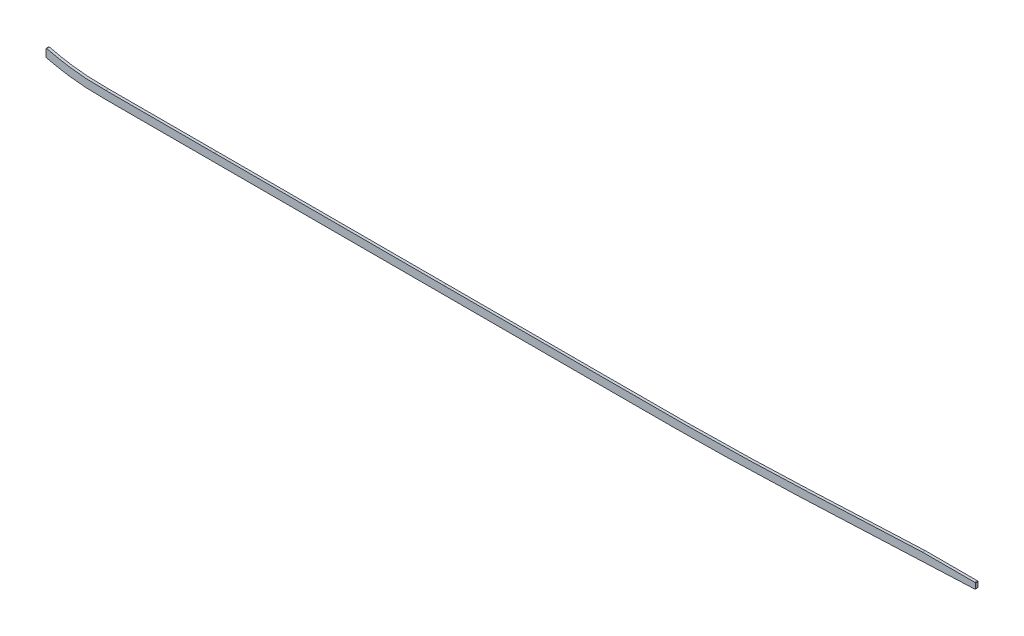
ISO-10303-21;
HEADER;
FILE_DESCRIPTION(('STEP AP214'),'2;1');
FILE_NAME('part.step','',(''),(''),'','','');
FILE_SCHEMA(('AUTOMOTIVE_DESIGN { 1 0 10303 214 1 1 1 1 }'));
ENDSEC;
DATA;
#1=APPLICATION_CONTEXT('core data for automotive mechanical design processes');
#2=APPLICATION_PROTOCOL_DEFINITION('international standard','automotive_design',2000,#1);
#3=PRODUCT_CONTEXT('',#1,'mechanical');
#4=PRODUCT('Part','Part','',(#3));
#5=PRODUCT_RELATED_PRODUCT_CATEGORY('part','',(#4));
#6=PRODUCT_DEFINITION_FORMATION('','',#4);
#7=PRODUCT_DEFINITION_CONTEXT('part definition',#1,'design');
#8=PRODUCT_DEFINITION('design','',#6,#7);
#9=PRODUCT_DEFINITION_SHAPE('','',#8);
#10=(LENGTH_UNIT() NAMED_UNIT(*) SI_UNIT(.MILLI.,.METRE.));
#11=(NAMED_UNIT(*) PLANE_ANGLE_UNIT() SI_UNIT($,.RADIAN.));
#12=(NAMED_UNIT(*) SI_UNIT($,.STERADIAN.) SOLID_ANGLE_UNIT());
#13=UNCERTAINTY_MEASURE_WITH_UNIT(LENGTH_MEASURE(1.E-05),#10,'distance_accuracy_value','');
#14=(GEOMETRIC_REPRESENTATION_CONTEXT(3) GLOBAL_UNCERTAINTY_ASSIGNED_CONTEXT((#13)) GLOBAL_UNIT_ASSIGNED_CONTEXT((#10,
#11,#12)) REPRESENTATION_CONTEXT('',''));
#15=CARTESIAN_POINT('',(0.,0.,0.));
#16=DIRECTION('',(0.,0.,1.));
#17=DIRECTION('',(1.,0.,0.));
#18=AXIS2_PLACEMENT_3D('',#15,#16,#17);
#19=CARTESIAN_POINT('',(2699.79233294449,-7.52454325644929,3.175));
#20=CARTESIAN_POINT('',(2639.63682069028,-11.6572294058032,3.175));
#21=CARTESIAN_POINT('',(2579.48130742255,-15.435846921513,3.175));
#22=CARTESIAN_POINT('',(2518.49810546626,-19.1485286488731,3.175));
#23=CARTESIAN_POINT('',(2436.3555443117,-23.2523639114786,3.175));
#24=CARTESIAN_POINT('',(2354.21298315715,-26.6314864233564,3.175));
#25=CARTESIAN_POINT('',(2332.5703304682,-27.4809881692809,3.175));
#26=CARTESIAN_POINT('',(2156.26863942885,-34.3777685431634,3.175));
#27=CARTESIAN_POINT('',(1979.96694737597,-41.6286312484567,3.175));
#28=CARTESIAN_POINT('',(1824.11427763497,-52.7712658766203,3.175));
#29=CARTESIAN_POINT('',(1636.92860677809,-53.5795698486924,3.175));
#30=CARTESIAN_POINT('',(1449.7429359212,-53.4540246131279,3.175));
#31=CARTESIAN_POINT('',(1418.00673093479,-53.4707027968771,3.175));
#32=CARTESIAN_POINT('',(1324.89933614602,-53.4707027968771,3.175));
#33=CARTESIAN_POINT('',(1231.79194034372,-53.4707027968771,3.175));
#34=CARTESIAN_POINT('',(1170.4412693194,-53.4707027968771,3.175));
#35=CARTESIAN_POINT('',(1108.78407581299,-53.4707027968771,3.175));
#36=CARTESIAN_POINT('',(1047.12688234629,-53.4707027968771,3.175));
#37=CARTESIAN_POINT('',(1046.84641418849,-53.4707027968771,3.175));
#38=CARTESIAN_POINT('',(1046.56594718406,-53.4707027968771,3.175));
#39=CARTESIAN_POINT('',(1046.28548189005,-53.4707027968771,3.175));
#40=(BOUNDED_CURVE() B_SPLINE_CURVE(5,(#19,#20,#21,#22,#23,#24,#25,#26,#27,#28,#29,#30,#31,#32,
#33,#34,#35,#36,#37,#38,#39),.UNSPECIFIED.,.F.,.F.) B_SPLINE_CURVE_WITH_KNOTS((6,3,3,3,3,3,6),
(100.654804519159,130.927896619159,141.337054719159,218.101815019159,233.772059419159,
264.077723219159,264.2162088),
.UNSPECIFIED.) CURVE() GEOMETRIC_REPRESENTATION_ITEM() RATIONAL_B_SPLINE_CURVE((1.,1.,1.,1.,1.,
1.,1.,1.,1.,1.,1.,1.,1.,1.,1.,1.,1.,1.,1.,1.,1.)) REPRESENTATION_ITEM(''));
#41=DIRECTION('',(0.,0.,-1.));
#42=VECTOR('',#41,1.);
#43=SURFACE_OF_LINEAR_EXTRUSION('',#40,#42);
#44=CARTESIAN_POINT('',(2699.79233294449,-7.52454325644929,-3.175));
#45=CARTESIAN_POINT('',(2639.63682069028,-11.6572294058032,-3.175));
#46=CARTESIAN_POINT('',(2579.48130742255,-15.435846921513,-3.175));
#47=CARTESIAN_POINT('',(2518.49810546626,-19.1485286488731,-3.175));
#48=CARTESIAN_POINT('',(2436.3555443117,-23.2523639114786,-3.175));
#49=CARTESIAN_POINT('',(2354.21298315715,-26.6314864233564,-3.175));
#50=CARTESIAN_POINT('',(2332.5703304682,-27.4809881692809,-3.175));
#51=CARTESIAN_POINT('',(2156.26863942885,-34.3777685431634,-3.175));
#52=CARTESIAN_POINT('',(1979.96694737597,-41.6286312484567,-3.175));
#53=CARTESIAN_POINT('',(1824.11427763497,-52.7712658766203,-3.175));
#54=CARTESIAN_POINT('',(1636.92860677809,-53.5795698486924,-3.175));
#55=CARTESIAN_POINT('',(1449.7429359212,-53.4540246131279,-3.175));
#56=CARTESIAN_POINT('',(1418.00673093479,-53.4707027968771,-3.175));
#57=CARTESIAN_POINT('',(1324.89933614602,-53.4707027968771,-3.175));
#58=CARTESIAN_POINT('',(1231.79194034372,-53.4707027968771,-3.175));
#59=CARTESIAN_POINT('',(1170.4412693194,-53.4707027968771,-3.175));
#60=CARTESIAN_POINT('',(1108.78407581299,-53.4707027968771,-3.175));
#61=CARTESIAN_POINT('',(1047.12688234629,-53.4707027968771,-3.175));
#62=CARTESIAN_POINT('',(1046.84641418849,-53.4707027968771,-3.175));
#63=CARTESIAN_POINT('',(1046.56594718406,-53.4707027968771,-3.175));
#64=CARTESIAN_POINT('',(1046.28548189005,-53.4707027968771,-3.175));
#65=(BOUNDED_CURVE() B_SPLINE_CURVE(5,(#44,#45,#46,#47,#48,#49,#50,#51,#52,#53,#54,#55,#56,#57,
#58,#59,#60,#61,#62,#63,#64),.UNSPECIFIED.,.F.,.F.) B_SPLINE_CURVE_WITH_KNOTS((6,3,3,3,3,3,6),
(100.654804519159,130.927896619159,141.337054719159,218.101815019159,233.772059419159,
264.077723219159,264.2162088),
.UNSPECIFIED.) CURVE() GEOMETRIC_REPRESENTATION_ITEM() RATIONAL_B_SPLINE_CURVE((1.,1.,1.,1.,1.,
1.,1.,1.,1.,1.,1.,1.,1.,1.,1.,1.,1.,1.,1.,1.,1.)) REPRESENTATION_ITEM(''));
#66=CARTESIAN_POINT('',(2310.1798600934,-28.3582988228307,-3.175));
#67=VERTEX_POINT('',#66);
#68=CARTESIAN_POINT('',(1046.28548189005,-53.4707027968771,-3.175));
#69=VERTEX_POINT('',#68);
#70=EDGE_CURVE('E200',#67,#69,#65,.T.);
#71=ORIENTED_EDGE('',*,*,#70,.F.);
#72=DIRECTION('',(0.,0.,-1.));
#73=VECTOR('',#72,1.);
#74=CARTESIAN_POINT('',(2310.1798600934,-28.3582988228307,-3.175));
#75=LINE('',#74,#73);
#76=CARTESIAN_POINT('',(2310.1798600934,-28.3582988228307,3.175));
#77=VERTEX_POINT('',#76);
#78=EDGE_CURVE('E203',#67,#77,#75,.F.);
#79=ORIENTED_EDGE('',*,*,#78,.T.);
#80=CARTESIAN_POINT('',(1046.28548189005,-53.4707027968771,3.175));
#81=VERTEX_POINT('',#80);
#82=EDGE_CURVE('E197',#77,#81,#40,.T.);
#83=ORIENTED_EDGE('',*,*,#82,.T.);
#84=DIRECTION('',(0.,0.,-1.));
#85=VECTOR('',#84,1.);
#86=CARTESIAN_POINT('',(1046.28548189005,-53.4707027968771,3.175));
#87=LINE('',#86,#85);
#88=EDGE_CURVE('E168',#81,#69,#87,.T.);
#89=ORIENTED_EDGE('',*,*,#88,.T.);
#90=EDGE_LOOP('',(#71,#79,#83,#89));
#91=FACE_BOUND('',#90,.T.);
#92=ADVANCED_FACE('F36',(#91),#43,.T.);
#93=CARTESIAN_POINT('',(2698.48667469404,11.4806601503293,3.175));
#94=CARTESIAN_POINT('',(2691.24737670604,10.9833200828121,3.175));
#95=CARTESIAN_POINT('',(2679.19516047804,10.1655376868452,3.175));
#96=CARTESIAN_POINT('',(2662.27652557768,9.03876140898899,3.175));
#97=CARTESIAN_POINT('',(2635.66628230206,7.2924691456857,3.175));
#98=CARTESIAN_POINT('',(2596.85766552893,4.8260568530791,3.175));
#99=CARTESIAN_POINT('',(2545.72974303923,1.75834409257586,3.175));
#100=CARTESIAN_POINT('',(2494.40530570724,-1.09855523520035,3.175));
#101=CARTESIAN_POINT('',(2451.53302226734,-3.26657329681936,3.175));
#102=CARTESIAN_POINT('',(2417.1983167563,-4.86708361008882,3.175));
#103=CARTESIAN_POINT('',(2391.45707691927,-6.00358923536048,3.175));
#104=CARTESIAN_POINT('',(2365.63473630713,-7.08685458139135,3.175));
#105=CARTESIAN_POINT('',(2339.54628467245,-8.13772994402807,3.175));
#106=CARTESIAN_POINT('',(2313.46613297408,-9.16513837136649,3.175));
#107=CARTESIAN_POINT('',(2287.61237548634,-10.1794782148021,3.175));
#108=CARTESIAN_POINT('',(2261.7633474368,-11.2010322967668,3.175));
#109=CARTESIAN_POINT('',(2227.28532971514,-12.5838425566113,3.175));
#110=CARTESIAN_POINT('',(2184.17556939327,-14.3660723604172,3.175));
#111=CARTESIAN_POINT('',(2132.42906611447,-16.6074278682384,3.175));
#112=CARTESIAN_POINT('',(2063.42552339989,-19.708920484548,3.175));
#113=CARTESIAN_POINT('',(1977.17490763451,-23.7005433130483,3.175));
#114=CARTESIAN_POINT('',(1873.73245143151,-28.149389220677,3.175));
#115=CARTESIAN_POINT('',(1770.37461881016,-31.6574686487852,3.175));
#116=CARTESIAN_POINT('',(1667.08568781321,-33.7931175563218,3.175));
#117=CARTESIAN_POINT('',(1581.01109449057,-34.3831888311612,3.175));
#118=CARTESIAN_POINT('',(1512.07397125959,-34.4278026003723,3.175));
#119=CARTESIAN_POINT('',(1443.06151347714,-34.4095104024296,3.175));
#120=CARTESIAN_POINT('',(1356.80092787913,-34.4244328117572,3.175));
#121=CARTESIAN_POINT('',(1218.79462695393,-34.4184647879491,3.175));
#122=CARTESIAN_POINT('',(1115.28902278569,-34.4207027968771,3.175));
#123=CARTESIAN_POINT('',(1046.28548189005,-34.4207027968771,3.175));
#124=B_SPLINE_CURVE_WITH_KNOTS('',3,(#93,#94,#95,#96,#97,#98,#99,#100,#101,#102,#103,#104,#105,
#106,#107,#108,#109,#110,#111,#112,#113,#114,#115,#116,#117,#118,#119,#120,#121,#122,#123),
.UNSPECIFIED.,.F.,.F.,(4,1,1,1,1,1,1,1,1,1,1,1,1,1,1,1,1,1,1,1,1,1,1,1,1,1,1,1,4),
(100.654804519159,102.842388131745,104.300777206802,105.766098402935,110.877392286712,
115.988686170488,121.099980054264,126.21127393804,128.766920879929,131.322567821817,
133.878214763705,136.433861705593,138.989508647481,141.545155589369,144.100802531257,
146.656449473146,151.767743356922,156.879037240698,161.990331124474,172.212918892027,
182.43550665958,192.658094427132,202.880682194685,213.103269962237,218.214563846014,
223.32585772979,233.548445497342,243.771033264895,264.2162088),.UNSPECIFIED.);
#125=DIRECTION('',(0.,0.,-1.));
#126=VECTOR('',#125,1.);
#127=SURFACE_OF_LINEAR_EXTRUSION('',#124,#126);
#128=CARTESIAN_POINT('',(2185.53298554095,-14.3256597243202,3.175));
#129=VERTEX_POINT('',#128);
#130=CARTESIAN_POINT('',(1046.28548189005,-34.4207027968771,3.175));
#131=VERTEX_POINT('',#130);
#132=EDGE_CURVE('E182',#129,#131,#124,.T.);
#133=ORIENTED_EDGE('',*,*,#132,.F.);
#134=CARTESIAN_POINT('',(2185.5329855252,-14.3256597249861,3.175));
#135=DIRECTION('',(0.,0.,-1.));
#136=VECTOR('',#135,1.);
#137=LINE('',#134,#136);
#138=CARTESIAN_POINT('',(2185.53298554095,-14.3256597243202,-3.175));
#139=VERTEX_POINT('',#138);
#140=EDGE_CURVE('E207',#139,#129,#137,.F.);
#141=ORIENTED_EDGE('',*,*,#140,.F.);
#142=CARTESIAN_POINT('',(2698.48667469404,11.4806601503293,-3.175));
#143=CARTESIAN_POINT('',(2691.24737670604,10.9833200828121,-3.175));
#144=CARTESIAN_POINT('',(2679.19516047804,10.1655376868452,-3.175));
#145=CARTESIAN_POINT('',(2662.27652557768,9.03876140898899,-3.175));
#146=CARTESIAN_POINT('',(2635.66628230206,7.2924691456857,-3.175));
#147=CARTESIAN_POINT('',(2596.85766552893,4.8260568530791,-3.175));
#148=CARTESIAN_POINT('',(2545.72974303923,1.75834409257586,-3.175));
#149=CARTESIAN_POINT('',(2494.40530570724,-1.09855523520035,-3.175));
#150=CARTESIAN_POINT('',(2451.53302226734,-3.26657329681936,-3.175));
#151=CARTESIAN_POINT('',(2417.1983167563,-4.86708361008882,-3.175));
#152=CARTESIAN_POINT('',(2391.45707691927,-6.00358923536048,-3.175));
#153=CARTESIAN_POINT('',(2365.63473630713,-7.08685458139135,-3.175));
#154=CARTESIAN_POINT('',(2339.54628467245,-8.13772994402807,-3.175));
#155=CARTESIAN_POINT('',(2313.46613297408,-9.16513837136649,-3.175));
#156=CARTESIAN_POINT('',(2287.61237548634,-10.1794782148021,-3.175));
#157=CARTESIAN_POINT('',(2261.7633474368,-11.2010322967668,-3.175));
#158=CARTESIAN_POINT('',(2227.28532971514,-12.5838425566113,-3.175));
#159=CARTESIAN_POINT('',(2184.17556939327,-14.3660723604172,-3.175));
#160=CARTESIAN_POINT('',(2132.42906611447,-16.6074278682384,-3.175));
#161=CARTESIAN_POINT('',(2063.42552339989,-19.708920484548,-3.175));
#162=CARTESIAN_POINT('',(1977.17490763451,-23.7005433130483,-3.175));
#163=CARTESIAN_POINT('',(1873.73245143151,-28.149389220677,-3.175));
#164=CARTESIAN_POINT('',(1770.37461881016,-31.6574686487852,-3.175));
#165=CARTESIAN_POINT('',(1667.08568781321,-33.7931175563218,-3.175));
#166=CARTESIAN_POINT('',(1581.01109449057,-34.3831888311612,-3.175));
#167=CARTESIAN_POINT('',(1512.07397125959,-34.4278026003723,-3.175));
#168=CARTESIAN_POINT('',(1443.06151347714,-34.4095104024296,-3.175));
#169=CARTESIAN_POINT('',(1356.80092787913,-34.4244328117572,-3.175));
#170=CARTESIAN_POINT('',(1218.79462695393,-34.4184647879491,-3.175));
#171=CARTESIAN_POINT('',(1115.28902278569,-34.4207027968771,-3.175));
#172=CARTESIAN_POINT('',(1046.28548189005,-34.4207027968771,-3.175));
#173=B_SPLINE_CURVE_WITH_KNOTS('',3,(#142,#143,#144,#145,#146,#147,#148,#149,#150,#151,#152,
#153,#154,#155,#156,#157,#158,#159,#160,#161,#162,#163,#164,#165,#166,#167,#168,#169,#170,#171,
#172),.UNSPECIFIED.,.F.,.F.,(4,1,1,1,1,1,1,1,1,1,1,1,1,1,1,1,1,1,1,1,1,1,1,1,1,1,1,1,4),
(100.654804519159,102.842388131745,104.300777206802,105.766098402935,110.877392286712,
115.988686170488,121.099980054264,126.21127393804,128.766920879929,131.322567821817,
133.878214763705,136.433861705593,138.989508647481,141.545155589369,144.100802531257,
146.656449473146,151.767743356922,156.879037240698,161.990331124474,172.212918892027,
182.43550665958,192.658094427132,202.880682194685,213.103269962237,218.214563846014,
223.32585772979,233.548445497342,243.771033264895,264.2162088),.UNSPECIFIED.);
#174=CARTESIAN_POINT('',(1046.28548189005,-34.4207027968771,-3.175));
#175=VERTEX_POINT('',#174);
#176=EDGE_CURVE('E166',#139,#175,#173,.T.);
#177=ORIENTED_EDGE('',*,*,#176,.T.);
#178=DIRECTION('',(0.,0.,-1.));
#179=VECTOR('',#178,1.);
#180=CARTESIAN_POINT('',(1046.28548189005,-34.4207027968771,3.175));
#181=LINE('',#180,#179);
#182=EDGE_CURVE('E149',#131,#175,#181,.T.);
#183=ORIENTED_EDGE('',*,*,#182,.F.);
#184=EDGE_LOOP('',(#133,#141,#177,#183));
#185=FACE_BOUND('',#184,.T.);
#186=ADVANCED_FACE('F306',(#185),#127,.F.);
#187=CARTESIAN_POINT('',(499.61002795047,-34.4207027968771,3.175));
#188=CARTESIAN_POINT('',(488.614737518052,-34.4207027968771,3.175));
#189=CARTESIAN_POINT('',(472.2363953645,-34.4207027983821,3.175));
#190=CARTESIAN_POINT('',(449.940231846129,-34.420702794369,3.175));
#191=CARTESIAN_POINT('',(427.771305694794,-34.4207028104213,3.175));
#192=CARTESIAN_POINT('',(405.874681662796,-34.4207027121004,3.175));
#193=CARTESIAN_POINT('',(384.584909127846,-34.4207029418503,3.175));
#194=CARTESIAN_POINT('',(368.900229326161,-34.4207022443236,3.175));
#195=CARTESIAN_POINT('',(353.376568613047,-34.4207048621181,3.175));
#196=CARTESIAN_POINT('',(332.608466434546,-34.4206891858564,3.175));
#197=CARTESIAN_POINT('',(306.287754852687,-34.4205700055106,3.175));
#198=CARTESIAN_POINT('',(274.023487704489,-34.4205382555166,3.175));
#199=CARTESIAN_POINT('',(252.271015965112,-34.4207097406393,3.175));
#200=CARTESIAN_POINT('',(241.425150133728,-34.4207027610987,3.175));
#201=B_SPLINE_CURVE_WITH_KNOTS('',3,(#187,#188,#189,#190,#191,#192,#193,#194,#195,#196,#197,
#198,#199,#200),.UNSPECIFIED.,.F.,.F.,(4,1,1,1,1,1,1,1,1,1,1,4),(19.9068295096932,
23.2201200173381,24.8767652711605,26.5334105249829,29.8467010326278,31.5033462864503,
33.1599915402727,34.8166367940951,36.4732820479176,39.7865725555625,43.0998630632073,
46.4131535708522),.UNSPECIFIED.);
#202=DIRECTION('',(0.,0.,-1.));
#203=VECTOR('',#202,1.);
#204=SURFACE_OF_LINEAR_EXTRUSION('',#201,#203);
#205=CARTESIAN_POINT('',(499.61002795047,-34.4207027968771,-3.175));
#206=CARTESIAN_POINT('',(488.614737518052,-34.4207027968771,-3.175));
#207=CARTESIAN_POINT('',(472.2363953645,-34.4207027983821,-3.175));
#208=CARTESIAN_POINT('',(449.940231846129,-34.420702794369,-3.175));
#209=CARTESIAN_POINT('',(427.771305694794,-34.4207028104213,-3.175));
#210=CARTESIAN_POINT('',(405.874681662796,-34.4207027121004,-3.175));
#211=CARTESIAN_POINT('',(384.584909127846,-34.4207029418503,-3.175));
#212=CARTESIAN_POINT('',(368.900229326161,-34.4207022443236,-3.175));
#213=CARTESIAN_POINT('',(353.376568613047,-34.4207048621181,-3.175));
#214=CARTESIAN_POINT('',(332.608466434546,-34.4206891858564,-3.175));
#215=CARTESIAN_POINT('',(306.287754852687,-34.4205700055106,-3.175));
#216=CARTESIAN_POINT('',(274.023487704489,-34.4205382555166,-3.175));
#217=CARTESIAN_POINT('',(252.271015965112,-34.4207097406393,-3.175));
#218=CARTESIAN_POINT('',(241.425150133728,-34.4207027610987,-3.175));
#219=B_SPLINE_CURVE_WITH_KNOTS('',3,(#205,#206,#207,#208,#209,#210,#211,#212,#213,#214,#215,
#216,#217,#218),.UNSPECIFIED.,.F.,.F.,(4,1,1,1,1,1,1,1,1,1,1,4),(19.9068295096932,
23.2201200173381,24.8767652711605,26.5334105249829,29.8467010326278,31.5033462864503,
33.1599915402727,34.8166367940951,36.4732820479176,39.7865725555625,43.0998630632073,
46.4131535708522),.UNSPECIFIED.);
#220=CARTESIAN_POINT('',(499.61002795047,-34.4207027968771,-3.175));
#221=VERTEX_POINT('',#220);
#222=CARTESIAN_POINT('',(241.425150133728,-34.4207027610987,-3.175));
#223=VERTEX_POINT('',#222);
#224=EDGE_CURVE('E158',#221,#223,#219,.T.);
#225=ORIENTED_EDGE('',*,*,#224,.T.);
#226=DIRECTION('',(0.,0.,-1.));
#227=VECTOR('',#226,1.);
#228=CARTESIAN_POINT('',(241.425150133728,-34.4207027610987,3.175));
#229=LINE('',#228,#227);
#230=CARTESIAN_POINT('',(241.425150133728,-34.4207027610987,3.175));
#231=VERTEX_POINT('',#230);
#232=EDGE_CURVE('E316',#231,#223,#229,.T.);
#233=ORIENTED_EDGE('',*,*,#232,.F.);
#234=CARTESIAN_POINT('',(499.61002795047,-34.4207027968771,3.175));
#235=VERTEX_POINT('',#234);
#236=EDGE_CURVE('E160',#235,#231,#201,.T.);
#237=ORIENTED_EDGE('',*,*,#236,.F.);
#238=DIRECTION('',(0.,0.,-1.));
#239=VECTOR('',#238,1.);
#240=CARTESIAN_POINT('',(499.61002795047,-34.4207027968771,3.175));
#241=LINE('',#240,#239);
#242=EDGE_CURVE('E146',#235,#221,#241,.T.);
#243=ORIENTED_EDGE('',*,*,#242,.T.);
#244=EDGE_LOOP('',(#225,#233,#237,#243));
#245=FACE_BOUND('',#244,.T.);
#246=ADVANCED_FACE('F156',(#245),#204,.F.);
#247=CARTESIAN_POINT('',(241.425150133727,-34.4207027610987,3.175));
#248=CARTESIAN_POINT('',(239.394928853346,-34.4207014546091,3.175));
#249=CARTESIAN_POINT('',(235.322322927437,-34.4204958673979,3.175));
#250=CARTESIAN_POINT('',(227.274423442791,-34.3987025326526,3.175));
#251=CARTESIAN_POINT('',(217.319360062366,-34.2974668549065,3.175));
#252=CARTESIAN_POINT('',(205.53069007675,-33.9763855631146,3.175));
#253=CARTESIAN_POINT('',(189.963341914105,-33.212641270811,3.175));
#254=CARTESIAN_POINT('',(170.696984653264,-31.5434951938744,3.175));
#255=CARTESIAN_POINT('',(147.533261231625,-28.3143981281075,3.175));
#256=CARTESIAN_POINT('',(125.482753205671,-24.2021098716678,3.175));
#257=CARTESIAN_POINT('',(107.439912034299,-20.1965093867304,3.175));
#258=CARTESIAN_POINT('',(92.2061475243642,-16.4882107680275,3.175));
#259=CARTESIAN_POINT('',(75.9504648179075,-12.2555284402728,3.175));
#260=CARTESIAN_POINT('',(63.6202017572794,-8.75888456222131,3.175));
#261=CARTESIAN_POINT('',(56.1680099981378,-6.51526799609147,3.175));
#262=B_SPLINE_CURVE_WITH_KNOTS('',3,(#247,#248,#249,#250,#251,#252,#253,#254,#255,#256,#257,
#258,#259,#260,#261),.UNSPECIFIED.,.F.,.F.,(4,1,1,1,1,1,1,1,1,1,1,1,4),(0.,0.622088422177912,
1.24417684435582,2.48835368871165,3.73253053306747,4.9767073774233,7.46506106613495,
9.9534147548466,12.4417684435582,14.5582354197025,15.8024122640584,17.4184758209815,
19.9068295096932),.UNSPECIFIED.);
#263=DIRECTION('',(0.,0.,-1.));
#264=VECTOR('',#263,1.);
#265=SURFACE_OF_LINEAR_EXTRUSION('',#262,#264);
#266=CARTESIAN_POINT('',(241.425150133727,-34.4207027610987,-3.175));
#267=CARTESIAN_POINT('',(239.394928853346,-34.4207014546091,-3.175));
#268=CARTESIAN_POINT('',(235.322322927437,-34.4204958673979,-3.175));
#269=CARTESIAN_POINT('',(227.274423442791,-34.3987025326526,-3.175));
#270=CARTESIAN_POINT('',(217.319360062366,-34.2974668549065,-3.175));
#271=CARTESIAN_POINT('',(205.53069007675,-33.9763855631146,-3.175));
#272=CARTESIAN_POINT('',(189.963341914105,-33.212641270811,-3.175));
#273=CARTESIAN_POINT('',(170.696984653264,-31.5434951938744,-3.175));
#274=CARTESIAN_POINT('',(147.533261231625,-28.3143981281075,-3.175));
#275=CARTESIAN_POINT('',(125.482753205671,-24.2021098716678,-3.175));
#276=CARTESIAN_POINT('',(107.439912034299,-20.1965093867304,-3.175));
#277=CARTESIAN_POINT('',(92.2061475243642,-16.4882107680275,-3.175));
#278=CARTESIAN_POINT('',(75.9504648179075,-12.2555284402728,-3.175));
#279=CARTESIAN_POINT('',(63.6202017572794,-8.75888456222131,-3.175));
#280=CARTESIAN_POINT('',(56.1680099981378,-6.51526799609147,-3.175));
#281=B_SPLINE_CURVE_WITH_KNOTS('',3,(#266,#267,#268,#269,#270,#271,#272,#273,#274,#275,#276,
#277,#278,#279,#280),.UNSPECIFIED.,.F.,.F.,(4,1,1,1,1,1,1,1,1,1,1,1,4),(0.,0.622088422177912,
1.24417684435582,2.48835368871165,3.73253053306747,4.9767073774233,7.46506106613495,
9.9534147548466,12.4417684435582,14.5582354197025,15.8024122640584,17.4184758209815,
19.9068295096932),.UNSPECIFIED.);
#282=CARTESIAN_POINT('',(100.627722923041,-18.5290378362012,-3.175));
#283=VERTEX_POINT('',#282);
#284=EDGE_CURVE('E161',#223,#283,#281,.T.);
#285=ORIENTED_EDGE('',*,*,#284,.T.);
#286=DIRECTION('',(0.,0.,-1.));
#287=VECTOR('',#286,1.);
#288=CARTESIAN_POINT('',(100.627722923041,-18.5290378362012,-3.175));
#289=LINE('',#288,#287);
#290=CARTESIAN_POINT('',(100.627722923041,-18.5290378362012,3.175));
#291=VERTEX_POINT('',#290);
#292=EDGE_CURVE('E11',#283,#291,#289,.F.);
#293=ORIENTED_EDGE('',*,*,#292,.T.);
#294=EDGE_CURVE('E271',#231,#291,#262,.T.);
#295=ORIENTED_EDGE('',*,*,#294,.F.);
#296=ORIENTED_EDGE('',*,*,#232,.T.);
#297=EDGE_LOOP('',(#285,#293,#295,#296));
#298=FACE_BOUND('',#297,.T.);
#299=ADVANCED_FACE('F348',(#298),#265,.F.);
#300=CARTESIAN_POINT('',(99.06,0.,3.175));
#301=DIRECTION('',(1.,0.,0.));
#302=DIRECTION('',(0.,1.,0.));
#303=AXIS2_PLACEMENT_3D('',#300,#301,#302);
#304=PLANE('',#303);
#305=DIRECTION('',(0.,-1.,0.));
#306=VECTOR('',#305,1.);
#307=CARTESIAN_POINT('',(99.06,0.,-3.175));
#308=LINE('',#307,#306);
#309=CARTESIAN_POINT('',(99.06,-19.7636475158555,-3.175));
#310=VERTEX_POINT('',#309);
#311=CARTESIAN_POINT('',(99.06,-36.7369267845074,-3.175));
#312=VERTEX_POINT('',#311);
#313=EDGE_CURVE('E260',#310,#312,#308,.T.);
#314=ORIENTED_EDGE('',*,*,#313,.T.);
#315=DIRECTION('',(0.,0.,1.));
#316=VECTOR('',#315,1.);
#317=CARTESIAN_POINT('',(99.06,-36.7369267845074,3.175));
#318=LINE('',#317,#316);
#319=CARTESIAN_POINT('',(99.06,-36.7369267845074,3.175));
#320=VERTEX_POINT('',#319);
#321=EDGE_CURVE('E44',#312,#320,#318,.T.);
#322=ORIENTED_EDGE('',*,*,#321,.T.);
#323=DIRECTION('',(0.,-1.,0.));
#324=VECTOR('',#323,1.);
#325=CARTESIAN_POINT('',(99.06,0.,3.175));
#326=LINE('',#325,#324);
#327=CARTESIAN_POINT('',(99.06,-19.7636475158555,3.175));
#328=VERTEX_POINT('',#327);
#329=EDGE_CURVE('E213',#328,#320,#326,.T.);
#330=ORIENTED_EDGE('',*,*,#329,.F.);
#331=DIRECTION('',(0.,0.,-1.));
#332=VECTOR('',#331,1.);
#333=CARTESIAN_POINT('',(99.06,-19.7636475158555,3.175));
#334=LINE('',#333,#332);
#335=EDGE_CURVE('E252',#328,#310,#334,.T.);
#336=ORIENTED_EDGE('',*,*,#335,.T.);
#337=EDGE_LOOP('',(#314,#322,#330,#336));
#338=FACE_BOUND('',#337,.T.);
#339=ADVANCED_FACE('F258',(#338),#304,.F.);
#340=CARTESIAN_POINT('',(241.425137874656,-53.4707027610947,3.175));
#341=CARTESIAN_POINT('',(224.286916993446,-53.4706917322934,3.175));
#342=CARTESIAN_POINT('',(207.149474966828,-53.46731537419,3.175));
#343=CARTESIAN_POINT('',(190.203897512927,-52.6865770783577,3.175));
#344=CARTESIAN_POINT('',(151.656098128873,-49.0318870359693,3.175));
#345=CARTESIAN_POINT('',(113.108298643588,-41.5036763395049,3.175));
#346=CARTESIAN_POINT('',(91.9499096911236,-36.3425549140717,3.175));
#347=CARTESIAN_POINT('',(71.3130359138117,-30.9695905800733,3.175));
#348=CARTESIAN_POINT('',(50.6761621364999,-24.7564879954398,3.175));
#349=(BOUNDED_CURVE() B_SPLINE_CURVE(5,(#340,#341,#342,#343,#344,#345,#346,#347,#348),
.UNSPECIFIED.,.F.,.F.) B_SPLINE_CURVE_WITH_KNOTS((6,3,6),(0.,8.71381607969319,19.9068295096932),
.UNSPECIFIED.) CURVE() GEOMETRIC_REPRESENTATION_ITEM() RATIONAL_B_SPLINE_CURVE((1.,1.,1.,1.,1.,
1.,1.,1.,1.)) REPRESENTATION_ITEM(''));
#350=DIRECTION('',(0.,0.,-1.));
#351=VECTOR('',#350,1.);
#352=SURFACE_OF_LINEAR_EXTRUSION('',#349,#351);
#353=CARTESIAN_POINT('',(241.425137874656,-53.4707027610947,3.175));
#354=VERTEX_POINT('',#353);
#355=CARTESIAN_POINT('',(100.038340121827,-37.9729828170011,3.175));
#356=VERTEX_POINT('',#355);
#357=EDGE_CURVE('E343',#354,#356,#349,.T.);
#358=ORIENTED_EDGE('',*,*,#357,.T.);
#359=DIRECTION('',(0.,0.,-1.));
#360=VECTOR('',#359,1.);
#361=CARTESIAN_POINT('',(100.038340121827,-37.9729828170012,3.175));
#362=LINE('',#361,#360);
#363=CARTESIAN_POINT('',(100.038340121827,-37.9729828170011,-3.175));
#364=VERTEX_POINT('',#363);
#365=EDGE_CURVE('E249',#356,#364,#362,.T.);
#366=ORIENTED_EDGE('',*,*,#365,.T.);
#367=CARTESIAN_POINT('',(241.425137874656,-53.4707027610947,-3.175));
#368=CARTESIAN_POINT('',(224.286916993446,-53.4706917322934,-3.175));
#369=CARTESIAN_POINT('',(207.149474966828,-53.46731537419,-3.175));
#370=CARTESIAN_POINT('',(190.203897512927,-52.6865770783577,-3.175));
#371=CARTESIAN_POINT('',(151.656098128873,-49.0318870359693,-3.175));
#372=CARTESIAN_POINT('',(113.108298643588,-41.5036763395049,-3.175));
#373=CARTESIAN_POINT('',(91.9499096911236,-36.3425549140717,-3.175));
#374=CARTESIAN_POINT('',(71.3130359138117,-30.9695905800733,-3.175));
#375=CARTESIAN_POINT('',(50.6761621364999,-24.7564879954398,-3.175));
#376=(BOUNDED_CURVE() B_SPLINE_CURVE(5,(#367,#368,#369,#370,#371,#372,#373,#374,#375),
.UNSPECIFIED.,.F.,.F.) B_SPLINE_CURVE_WITH_KNOTS((6,3,6),(0.,8.71381607969319,19.9068295096932),
.UNSPECIFIED.) CURVE() GEOMETRIC_REPRESENTATION_ITEM() RATIONAL_B_SPLINE_CURVE((1.,1.,1.,1.,1.,
1.,1.,1.,1.)) REPRESENTATION_ITEM(''));
#377=CARTESIAN_POINT('',(241.425137874656,-53.4707027610947,-3.175));
#378=VERTEX_POINT('',#377);
#379=EDGE_CURVE('E233',#378,#364,#376,.T.);
#380=ORIENTED_EDGE('',*,*,#379,.F.);
#381=DIRECTION('',(0.,0.,-1.));
#382=VECTOR('',#381,1.);
#383=CARTESIAN_POINT('',(241.425137874656,-53.4707027610947,3.175));
#384=LINE('',#383,#382);
#385=EDGE_CURVE('E422',#354,#378,#384,.T.);
#386=ORIENTED_EDGE('',*,*,#385,.F.);
#387=EDGE_LOOP('',(#358,#366,#380,#386));
#388=FACE_BOUND('',#387,.T.);
#389=ADVANCED_FACE('F407',(#388),#352,.T.);
#390=CARTESIAN_POINT('',(499.61002795047,-53.4707027968771,3.175));
#391=CARTESIAN_POINT('',(492.13682083511,-53.4707027968771,3.175));
#392=CARTESIAN_POINT('',(484.754348064359,-53.4707027968771,3.175));
#393=CARTESIAN_POINT('',(477.443025858661,-53.4707027968771,3.175));
#394=CARTESIAN_POINT('',(448.516583144859,-53.4707027968771,3.175));
#395=CARTESIAN_POINT('',(419.590140516906,-53.4707027968771,3.175));
#396=CARTESIAN_POINT('',(398.368118521171,-53.4707027968771,3.175));
#397=CARTESIAN_POINT('',(355.647540185946,-53.4707027968771,3.175));
#398=CARTESIAN_POINT('',(312.926961850721,-53.4707027968771,3.175));
#399=CARTESIAN_POINT('',(289.235090436449,-53.4702930294301,3.175));
#400=CARTESIAN_POINT('',(265.364963651298,-53.4707050337029,3.175));
#401=CARTESIAN_POINT('',(241.494836900486,-53.4707027893221,3.175));
#402=CARTESIAN_POINT('',(241.471603890762,-53.470702784812,3.175));
#403=CARTESIAN_POINT('',(241.448370881994,-53.4707027760456,3.175));
#404=CARTESIAN_POINT('',(241.425137874656,-53.4707027610947,3.175));
#405=(BOUNDED_CURVE() B_SPLINE_CURVE(5,(#390,#391,#392,#393,#394,#395,#396,#397,#398,#399,#400,
#401,#402,#403,#404),.UNSPECIFIED.,.F.,.F.) B_SPLINE_CURVE_WITH_KNOTS((6,3,3,3,6),
(19.9068295096932,23.6378973105454,34.2765455705454,46.4013409005454,46.4131535708522),
.UNSPECIFIED.) CURVE() GEOMETRIC_REPRESENTATION_ITEM() RATIONAL_B_SPLINE_CURVE((1.,1.,1.,1.,1.,
1.,1.,1.,1.,1.,1.,1.,1.,1.,1.)) REPRESENTATION_ITEM(''));
#406=DIRECTION('',(0.,0.,-1.));
#407=VECTOR('',#406,1.);
#408=SURFACE_OF_LINEAR_EXTRUSION('',#405,#407);
#409=CARTESIAN_POINT('',(499.61002795047,-53.4707027968771,-3.175));
#410=CARTESIAN_POINT('',(492.13682083511,-53.4707027968771,-3.175));
#411=CARTESIAN_POINT('',(484.754348064359,-53.4707027968771,-3.175));
#412=CARTESIAN_POINT('',(477.443025858661,-53.4707027968771,-3.175));
#413=CARTESIAN_POINT('',(448.516583144859,-53.4707027968771,-3.175));
#414=CARTESIAN_POINT('',(419.590140516906,-53.4707027968771,-3.175));
#415=CARTESIAN_POINT('',(398.368118521171,-53.4707027968771,-3.175));
#416=CARTESIAN_POINT('',(355.647540185946,-53.4707027968771,-3.175));
#417=CARTESIAN_POINT('',(312.926961850721,-53.4707027968771,-3.175));
#418=CARTESIAN_POINT('',(289.235090436449,-53.4702930294301,-3.175));
#419=CARTESIAN_POINT('',(265.364963651298,-53.4707050337029,-3.175));
#420=CARTESIAN_POINT('',(241.494836900486,-53.4707027893221,-3.175));
#421=CARTESIAN_POINT('',(241.471603890762,-53.470702784812,-3.175));
#422=CARTESIAN_POINT('',(241.448370881994,-53.4707027760456,-3.175));
#423=CARTESIAN_POINT('',(241.425137874656,-53.4707027610947,-3.175));
#424=(BOUNDED_CURVE() B_SPLINE_CURVE(5,(#409,#410,#411,#412,#413,#414,#415,#416,#417,#418,#419,
#420,#421,#422,#423),.UNSPECIFIED.,.F.,.F.) B_SPLINE_CURVE_WITH_KNOTS((6,3,3,3,6),
(19.9068295096932,23.6378973105454,34.2765455705454,46.4013409005454,46.4131535708522),
.UNSPECIFIED.) CURVE() GEOMETRIC_REPRESENTATION_ITEM() RATIONAL_B_SPLINE_CURVE((1.,1.,1.,1.,1.,
1.,1.,1.,1.,1.,1.,1.,1.,1.,1.)) REPRESENTATION_ITEM(''));
#425=CARTESIAN_POINT('',(499.61002795047,-53.4707027968771,-3.175));
#426=VERTEX_POINT('',#425);
#427=EDGE_CURVE('E294',#426,#378,#424,.T.);
#428=ORIENTED_EDGE('',*,*,#427,.F.);
#429=DIRECTION('',(0.,0.,-1.));
#430=VECTOR('',#429,1.);
#431=CARTESIAN_POINT('',(499.61002795047,-53.4707027968771,3.175));
#432=LINE('',#431,#430);
#433=CARTESIAN_POINT('',(499.61002795047,-53.4707027968771,3.175));
#434=VERTEX_POINT('',#433);
#435=EDGE_CURVE('E152',#434,#426,#432,.T.);
#436=ORIENTED_EDGE('',*,*,#435,.F.);
#437=EDGE_CURVE('E344',#434,#354,#405,.T.);
#438=ORIENTED_EDGE('',*,*,#437,.T.);
#439=ORIENTED_EDGE('',*,*,#385,.T.);
#440=EDGE_LOOP('',(#428,#436,#438,#439));
#441=FACE_BOUND('',#440,.T.);
#442=ADVANCED_FACE('F410',(#441),#408,.T.);
#443=CARTESIAN_POINT('',(0.,-53.4707027968771,3.175));
#444=DIRECTION('',(0.,-1.,0.));
#445=DIRECTION('',(0.,0.,-1.));
#446=AXIS2_PLACEMENT_3D('',#443,#444,#445);
#447=PLANE('',#446);
#448=DIRECTION('',(-1.,0.,0.));
#449=VECTOR('',#448,1.);
#450=CARTESIAN_POINT('',(0.,-53.4707027968771,-3.175));
#451=LINE('',#450,#449);
#452=EDGE_CURVE('E293',#69,#426,#451,.T.);
#453=ORIENTED_EDGE('',*,*,#452,.F.);
#454=ORIENTED_EDGE('',*,*,#88,.F.);
#455=DIRECTION('',(-1.,0.,0.));
#456=VECTOR('',#455,1.);
#457=CARTESIAN_POINT('',(0.,-53.4707027968771,3.175));
#458=LINE('',#457,#456);
#459=EDGE_CURVE('E187',#81,#434,#458,.T.);
#460=ORIENTED_EDGE('',*,*,#459,.T.);
#461=ORIENTED_EDGE('',*,*,#435,.T.);
#462=EDGE_LOOP('',(#453,#454,#460,#461));
#463=FACE_BOUND('',#462,.T.);
#464=ADVANCED_FACE('F435',(#463),#447,.T.);
#465=CARTESIAN_POINT('',(0.,-34.4207027968772,3.175));
#466=DIRECTION('',(0.,-1.,0.));
#467=DIRECTION('',(1.,0.,0.));
#468=AXIS2_PLACEMENT_3D('',#465,#466,#467);
#469=PLANE('',#468);
#470=DIRECTION('',(-1.,0.,0.));
#471=VECTOR('',#470,1.);
#472=CARTESIAN_POINT('',(0.,-34.4207027968772,-3.175));
#473=LINE('',#472,#471);
#474=EDGE_CURVE('E142',#175,#221,#473,.T.);
#475=ORIENTED_EDGE('',*,*,#474,.T.);
#476=ORIENTED_EDGE('',*,*,#242,.F.);
#477=DIRECTION('',(-1.,0.,0.));
#478=VECTOR('',#477,1.);
#479=CARTESIAN_POINT('',(0.,-34.4207027968772,3.175));
#480=LINE('',#479,#478);
#481=EDGE_CURVE('E177',#131,#235,#480,.T.);
#482=ORIENTED_EDGE('',*,*,#481,.F.);
#483=ORIENTED_EDGE('',*,*,#182,.T.);
#484=EDGE_LOOP('',(#475,#476,#482,#483));
#485=FACE_BOUND('',#484,.T.);
#486=ADVANCED_FACE('F144',(#485),#469,.F.);
#487=CARTESIAN_POINT('',(0.,0.,3.175));
#488=DIRECTION('',(0.,0.,1.));
#489=DIRECTION('',(1.,0.,0.));
#490=AXIS2_PLACEMENT_3D('',#487,#488,#489);
#491=PLANE('',#490);
#492=ORIENTED_EDGE('',*,*,#82,.F.);
#493=CARTESIAN_POINT('',(2310.12999999994,-27.0892779518124,3.175));
#494=DIRECTION('',(0.,0.,1.));
#495=DIRECTION('',(1.,0.,0.));
#496=AXIS2_PLACEMENT_3D('',#493,#494,#495);
#497=CIRCLE('',#496,1.27);
#498=CARTESIAN_POINT('',(2311.39999999994,-27.0892779518188,3.175));
#499=VERTEX_POINT('',#498);
#500=EDGE_CURVE('E234',#77,#499,#497,.T.);
#501=ORIENTED_EDGE('',*,*,#500,.T.);
#502=DIRECTION('',(4.98289074044362E-12,1.,0.));
#503=VECTOR('',#502,1.);
#504=CARTESIAN_POINT('',(2311.40000000007,-1.15174536574617E-08,3.175));
#505=LINE('',#504,#503);
#506=CARTESIAN_POINT('',(2311.39999999999,-15.5956597249742,3.175));
#507=VERTEX_POINT('',#506);
#508=EDGE_CURVE('E208',#499,#507,#505,.T.);
#509=ORIENTED_EDGE('',*,*,#508,.T.);
#510=CARTESIAN_POINT('',(2310.12999999999,-15.5956597249679,3.175));
#511=DIRECTION('',(0.,0.,1.));
#512=DIRECTION('',(1.,0.,0.));
#513=AXIS2_PLACEMENT_3D('',#510,#511,#512);
#514=CIRCLE('',#513,1.27);
#515=CARTESIAN_POINT('',(2310.12999999999,-14.3256597249679,3.175));
#516=VERTEX_POINT('',#515);
#517=EDGE_CURVE('E275',#507,#516,#514,.T.);
#518=ORIENTED_EDGE('',*,*,#517,.T.);
#519=DIRECTION('',(1.,1.46807919002516E-13,0.));
#520=VECTOR('',#519,1.);
#521=CARTESIAN_POINT('',(2.10312029261048E-12,-14.325659725307,3.175));
#522=LINE('',#521,#520);
#523=EDGE_CURVE('E221',#129,#516,#522,.T.);
#524=ORIENTED_EDGE('',*,*,#523,.F.);
#525=ORIENTED_EDGE('',*,*,#132,.T.);
#526=ORIENTED_EDGE('',*,*,#481,.T.);
#527=ORIENTED_EDGE('',*,*,#236,.T.);
#528=ORIENTED_EDGE('',*,*,#294,.T.);
#529=CARTESIAN_POINT('',(100.33,-19.7636475158555,3.175));
#530=DIRECTION('',(0.,0.,1.));
#531=DIRECTION('',(1.,0.,0.));
#532=AXIS2_PLACEMENT_3D('',#529,#530,#531);
#533=CIRCLE('',#532,1.27);
#534=EDGE_CURVE('E206',#291,#328,#533,.T.);
#535=ORIENTED_EDGE('',*,*,#534,.T.);
#536=ORIENTED_EDGE('',*,*,#329,.T.);
#537=CARTESIAN_POINT('',(100.33,-36.7369267845074,3.175));
#538=DIRECTION('',(0.,0.,1.));
#539=DIRECTION('',(1.,0.,0.));
#540=AXIS2_PLACEMENT_3D('',#537,#538,#539);
#541=CIRCLE('',#540,1.27);
#542=EDGE_CURVE('E267',#320,#356,#541,.T.);
#543=ORIENTED_EDGE('',*,*,#542,.T.);
#544=ORIENTED_EDGE('',*,*,#357,.F.);
#545=ORIENTED_EDGE('',*,*,#437,.F.);
#546=ORIENTED_EDGE('',*,*,#459,.F.);
#547=EDGE_LOOP('',(#492,#501,#509,#518,#524,#525,#526,#527,#528,#535,#536,#543,#544,#545,#546));
#548=FACE_BOUND('',#547,.T.);
#549=ADVANCED_FACE('F265',(#548),#491,.T.);
#550=CARTESIAN_POINT('',(0.,0.,-3.175));
#551=DIRECTION('',(0.,0.,1.));
#552=DIRECTION('',(1.,0.,0.));
#553=AXIS2_PLACEMENT_3D('',#550,#551,#552);
#554=PLANE('',#553);
#555=DIRECTION('',(4.98289074044362E-12,1.,0.));
#556=VECTOR('',#555,1.);
#557=CARTESIAN_POINT('',(2311.40000000007,-1.15174536574617E-08,-3.175));
#558=LINE('',#557,#556);
#559=CARTESIAN_POINT('',(2311.39999999994,-27.0892779518188,-3.175));
#560=VERTEX_POINT('',#559);
#561=CARTESIAN_POINT('',(2311.39999999999,-15.5956597249742,-3.175));
#562=VERTEX_POINT('',#561);
#563=EDGE_CURVE('E224',#560,#562,#558,.T.);
#564=ORIENTED_EDGE('',*,*,#563,.F.);
#565=CARTESIAN_POINT('',(2310.12999999994,-27.0892779518124,-3.175));
#566=DIRECTION('',(0.,0.,1.));
#567=DIRECTION('',(1.,0.,0.));
#568=AXIS2_PLACEMENT_3D('',#565,#566,#567);
#569=CIRCLE('',#568,1.27);
#570=EDGE_CURVE('E245',#560,#67,#569,.F.);
#571=ORIENTED_EDGE('',*,*,#570,.T.);
#572=ORIENTED_EDGE('',*,*,#70,.T.);
#573=ORIENTED_EDGE('',*,*,#452,.T.);
#574=ORIENTED_EDGE('',*,*,#427,.T.);
#575=ORIENTED_EDGE('',*,*,#379,.T.);
#576=CARTESIAN_POINT('',(100.33,-36.7369267845074,-3.175));
#577=DIRECTION('',(0.,0.,1.));
#578=DIRECTION('',(1.,0.,0.));
#579=AXIS2_PLACEMENT_3D('',#576,#577,#578);
#580=CIRCLE('',#579,1.27);
#581=EDGE_CURVE('E57',#364,#312,#580,.F.);
#582=ORIENTED_EDGE('',*,*,#581,.T.);
#583=ORIENTED_EDGE('',*,*,#313,.F.);
#584=CARTESIAN_POINT('',(100.33,-19.7636475158555,-3.175));
#585=DIRECTION('',(0.,0.,1.));
#586=DIRECTION('',(1.,0.,0.));
#587=AXIS2_PLACEMENT_3D('',#584,#585,#586);
#588=CIRCLE('',#587,1.27);
#589=EDGE_CURVE('E51',#310,#283,#588,.F.);
#590=ORIENTED_EDGE('',*,*,#589,.T.);
#591=ORIENTED_EDGE('',*,*,#284,.F.);
#592=ORIENTED_EDGE('',*,*,#224,.F.);
#593=ORIENTED_EDGE('',*,*,#474,.F.);
#594=ORIENTED_EDGE('',*,*,#176,.F.);
#595=DIRECTION('',(1.,1.46807919002516E-13,0.));
#596=VECTOR('',#595,1.);
#597=CARTESIAN_POINT('',(2.10312029261048E-12,-14.325659725307,-3.175));
#598=LINE('',#597,#596);
#599=CARTESIAN_POINT('',(2310.12999999999,-14.3256597249679,-3.175));
#600=VERTEX_POINT('',#599);
#601=EDGE_CURVE('E212',#139,#600,#598,.T.);
#602=ORIENTED_EDGE('',*,*,#601,.T.);
#603=CARTESIAN_POINT('',(2310.12999999999,-15.5956597249679,-3.175));
#604=DIRECTION('',(0.,0.,1.));
#605=DIRECTION('',(1.,0.,0.));
#606=AXIS2_PLACEMENT_3D('',#603,#604,#605);
#607=CIRCLE('',#606,1.27);
#608=EDGE_CURVE('E243',#600,#562,#607,.F.);
#609=ORIENTED_EDGE('',*,*,#608,.T.);
#610=EDGE_LOOP('',(#564,#571,#572,#573,#574,#575,#582,#583,#590,#591,#592,#593,#594,#602,#609));
#611=FACE_BOUND('',#610,.T.);
#612=ADVANCED_FACE('F164',(#611),#554,.F.);
#613=CARTESIAN_POINT('',(2311.40000000007,-1.15174536574617E-08,-3.175));
#614=DIRECTION('',(1.,-4.98289074044362E-12,0.));
#615=DIRECTION('',(4.98289074044362E-12,1.,0.));
#616=AXIS2_PLACEMENT_3D('',#613,#614,#615);
#617=PLANE('',#616);
#618=ORIENTED_EDGE('',*,*,#508,.F.);
#619=DIRECTION('',(0.,0.,-1.));
#620=VECTOR('',#619,1.);
#621=CARTESIAN_POINT('',(2311.39999999994,-27.0892779518188,-3.175));
#622=LINE('',#621,#620);
#623=EDGE_CURVE('E239',#499,#560,#622,.T.);
#624=ORIENTED_EDGE('',*,*,#623,.T.);
#625=ORIENTED_EDGE('',*,*,#563,.T.);
#626=DIRECTION('',(0.,0.,1.));
#627=VECTOR('',#626,1.);
#628=CARTESIAN_POINT('',(2311.39999999999,-15.5956597249742,3.175));
#629=LINE('',#628,#627);
#630=EDGE_CURVE('E236',#562,#507,#629,.T.);
#631=ORIENTED_EDGE('',*,*,#630,.T.);
#632=EDGE_LOOP('',(#618,#624,#625,#631));
#633=FACE_BOUND('',#632,.T.);
#634=ADVANCED_FACE('F283',(#633),#617,.T.);
#635=CARTESIAN_POINT('',(2.10312029261048E-12,-14.325659725307,-3.175));
#636=DIRECTION('',(1.46807919002516E-13,-1.,0.));
#637=DIRECTION('',(1.,1.46807919002516E-13,0.));
#638=AXIS2_PLACEMENT_3D('',#635,#636,#637);
#639=PLANE('',#638);
#640=ORIENTED_EDGE('',*,*,#523,.T.);
#641=DIRECTION('',(0.,0.,1.));
#642=VECTOR('',#641,1.);
#643=CARTESIAN_POINT('',(2310.12999999999,-14.3256597249679,-3.175));
#644=LINE('',#643,#642);
#645=EDGE_CURVE('E247',#516,#600,#644,.F.);
#646=ORIENTED_EDGE('',*,*,#645,.T.);
#647=ORIENTED_EDGE('',*,*,#601,.F.);
#648=ORIENTED_EDGE('',*,*,#140,.T.);
#649=EDGE_LOOP('',(#640,#646,#647,#648));
#650=FACE_BOUND('',#649,.T.);
#651=ADVANCED_FACE('F367',(#650),#639,.F.);
#652=CARTESIAN_POINT('',(2310.12999999994,-27.0892779518124,0.));
#653=DIRECTION('',(0.,0.,-1.));
#654=DIRECTION('',(-1.,0.,0.));
#655=AXIS2_PLACEMENT_3D('',#652,#653,#654);
#656=CYLINDRICAL_SURFACE('',#655,1.27);
#657=ORIENTED_EDGE('',*,*,#570,.F.);
#658=ORIENTED_EDGE('',*,*,#623,.F.);
#659=ORIENTED_EDGE('',*,*,#500,.F.);
#660=ORIENTED_EDGE('',*,*,#78,.F.);
#661=EDGE_LOOP('',(#657,#658,#659,#660));
#662=FACE_BOUND('',#661,.T.);
#663=ADVANCED_FACE('F286',(#662),#656,.T.);
#664=CARTESIAN_POINT('',(2310.12999999999,-15.5956597249679,-3.175));
#665=DIRECTION('',(0.,0.,-1.));
#666=DIRECTION('',(-1.,0.,0.));
#667=AXIS2_PLACEMENT_3D('',#664,#665,#666);
#668=CYLINDRICAL_SURFACE('',#667,1.27);
#669=ORIENTED_EDGE('',*,*,#608,.F.);
#670=ORIENTED_EDGE('',*,*,#645,.F.);
#671=ORIENTED_EDGE('',*,*,#517,.F.);
#672=ORIENTED_EDGE('',*,*,#630,.F.);
#673=EDGE_LOOP('',(#669,#670,#671,#672));
#674=FACE_BOUND('',#673,.T.);
#675=ADVANCED_FACE('F354',(#674),#668,.T.);
#676=CARTESIAN_POINT('',(100.33,-36.7369267845074,0.));
#677=DIRECTION('',(0.,0.,-1.));
#678=DIRECTION('',(-1.,0.,0.));
#679=AXIS2_PLACEMENT_3D('',#676,#677,#678);
#680=CYLINDRICAL_SURFACE('',#679,1.27);
#681=ORIENTED_EDGE('',*,*,#542,.F.);
#682=ORIENTED_EDGE('',*,*,#321,.F.);
#683=ORIENTED_EDGE('',*,*,#581,.F.);
#684=ORIENTED_EDGE('',*,*,#365,.F.);
#685=EDGE_LOOP('',(#681,#682,#683,#684));
#686=FACE_BOUND('',#685,.T.);
#687=ADVANCED_FACE('F274',(#686),#680,.T.);
#688=CARTESIAN_POINT('',(100.33,-19.7636475158555,0.));
#689=DIRECTION('',(0.,0.,-1.));
#690=DIRECTION('',(-1.,0.,0.));
#691=AXIS2_PLACEMENT_3D('',#688,#689,#690);
#692=CYLINDRICAL_SURFACE('',#691,1.27);
#693=ORIENTED_EDGE('',*,*,#534,.F.);
#694=ORIENTED_EDGE('',*,*,#292,.F.);
#695=ORIENTED_EDGE('',*,*,#589,.F.);
#696=ORIENTED_EDGE('',*,*,#335,.F.);
#697=EDGE_LOOP('',(#693,#694,#695,#696));
#698=FACE_BOUND('',#697,.T.);
#699=ADVANCED_FACE('F38',(#698),#692,.T.);
#700=CLOSED_SHELL('',(#92,#186,#246,#299,#339,#389,#442,#464,#486,#549,#612,#634,#651,#663,#675,
#687,#699));
#701=MANIFOLD_SOLID_BREP('B2',#700);
#702=ADVANCED_BREP_SHAPE_REPRESENTATION('',(#18,#701),#14);
#703=SHAPE_DEFINITION_REPRESENTATION(#9,#702);
ENDSEC;
END-ISO-10303-21;
